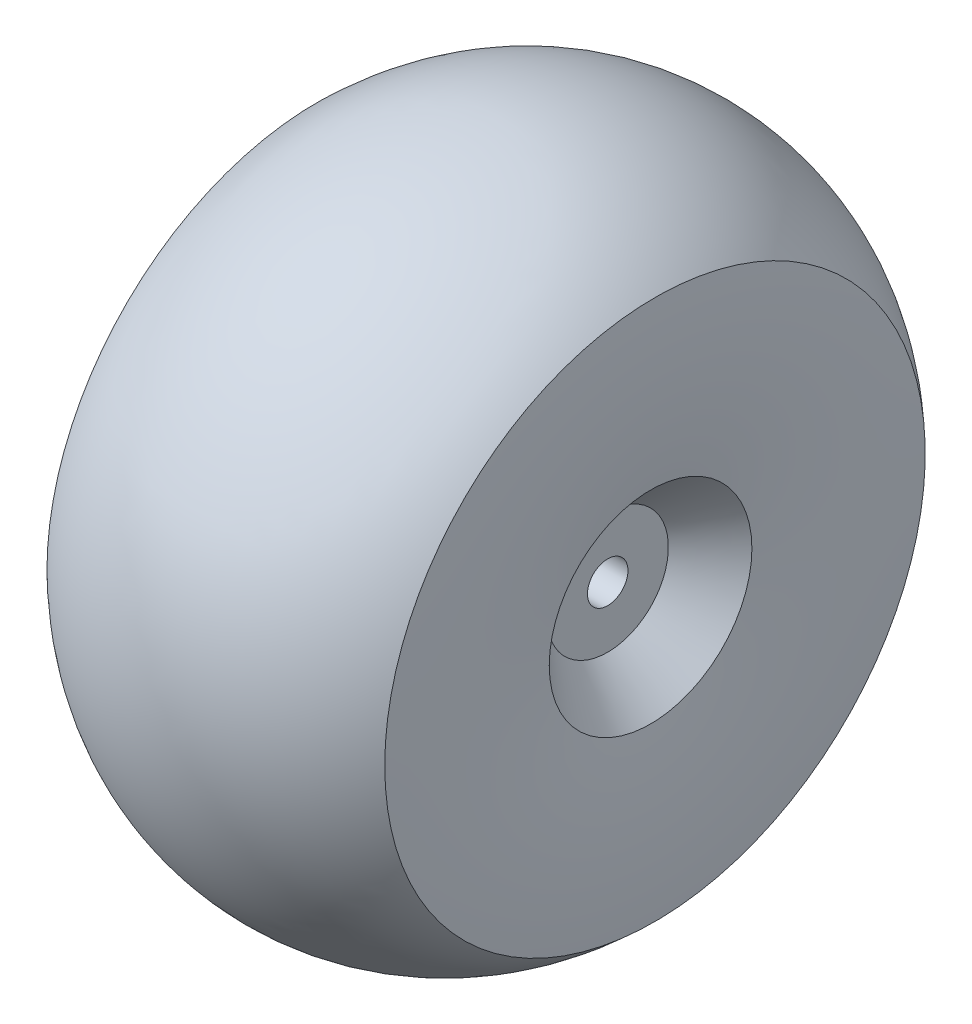
ISO-10303-21;
HEADER;
FILE_DESCRIPTION(('STEP AP214'),'2;1');
FILE_NAME('part.step','',(''),(''),'','','');
FILE_SCHEMA(('AUTOMOTIVE_DESIGN { 1 0 10303 214 1 1 1 1 }'));
ENDSEC;
DATA;
#1=APPLICATION_CONTEXT('core data for automotive mechanical design processes');
#2=APPLICATION_PROTOCOL_DEFINITION('international standard','automotive_design',2000,#1);
#3=PRODUCT_CONTEXT('',#1,'mechanical');
#4=PRODUCT('Part','Part','',(#3));
#5=PRODUCT_RELATED_PRODUCT_CATEGORY('part','',(#4));
#6=PRODUCT_DEFINITION_FORMATION('','',#4);
#7=PRODUCT_DEFINITION_CONTEXT('part definition',#1,'design');
#8=PRODUCT_DEFINITION('design','',#6,#7);
#9=PRODUCT_DEFINITION_SHAPE('','',#8);
#10=(LENGTH_UNIT() NAMED_UNIT(*) SI_UNIT(.MILLI.,.METRE.));
#11=(NAMED_UNIT(*) PLANE_ANGLE_UNIT() SI_UNIT($,.RADIAN.));
#12=(NAMED_UNIT(*) SI_UNIT($,.STERADIAN.) SOLID_ANGLE_UNIT());
#13=UNCERTAINTY_MEASURE_WITH_UNIT(LENGTH_MEASURE(1.E-05),#10,'distance_accuracy_value','');
#14=(GEOMETRIC_REPRESENTATION_CONTEXT(3) GLOBAL_UNCERTAINTY_ASSIGNED_CONTEXT((#13)) GLOBAL_UNIT_ASSIGNED_CONTEXT((#10,
#11,#12)) REPRESENTATION_CONTEXT('',''));
#15=CARTESIAN_POINT('',(0.,0.,0.));
#16=DIRECTION('',(0.,0.,1.));
#17=DIRECTION('',(1.,0.,0.));
#18=AXIS2_PLACEMENT_3D('',#15,#16,#17);
#19=CARTESIAN_POINT('',(-52.6401972971853,0.,0.));
#20=DIRECTION('',(-1.,0.,0.));
#21=DIRECTION('',(0.,0.,1.));
#22=AXIS2_PLACEMENT_3D('',#19,#20,#21);
#23=DEGENERATE_TOROIDAL_SURFACE('',#22,15.4514704568728,65.2988087557571,.T.);
#24=CARTESIAN_POINT('',(12.5,0.,0.));
#25=DIRECTION('',(-1.,0.,0.));
#26=DIRECTION('',(0.,0.,1.));
#27=AXIS2_PLACEMENT_3D('',#24,#25,#26);
#28=CIRCLE('',#27,20.);
#29=CARTESIAN_POINT('',(12.5,0.,20.));
#30=VERTEX_POINT('',#29);
#31=EDGE_CURVE('E74',#30,#30,#28,.T.);
#32=ORIENTED_EDGE('',*,*,#31,.F.);
#33=EDGE_LOOP('',(#32));
#34=FACE_BOUND('',#33,.T.);
#35=CARTESIAN_POINT('',(12.1726759803852,0.,0.));
#36=DIRECTION('',(-1.,0.,0.));
#37=DIRECTION('',(0.,0.,1.));
#38=AXIS2_PLACEMENT_3D('',#35,#36,#37);
#39=CIRCLE('',#38,7.5);
#40=CARTESIAN_POINT('',(12.1726759803852,0.,7.5));
#41=VERTEX_POINT('',#40);
#42=EDGE_CURVE('E10',#41,#41,#39,.T.);
#43=ORIENTED_EDGE('',*,*,#42,.T.);
#44=EDGE_LOOP('',(#43));
#45=FACE_BOUND('',#44,.T.);
#46=ADVANCED_FACE('F39',(#34,#45),#23,.T.);
#47=CARTESIAN_POINT('',(9.,0.,0.));
#48=DIRECTION('',(1.,0.,0.));
#49=DIRECTION('',(0.,0.,-1.));
#50=AXIS2_PLACEMENT_3D('',#47,#48,#49);
#51=CONICAL_SURFACE('',#50,4.48924291294705,0.75921822461754);
#52=ORIENTED_EDGE('',*,*,#42,.F.);
#53=EDGE_LOOP('',(#52));
#54=FACE_BOUND('',#53,.T.);
#55=CARTESIAN_POINT('',(9.,0.,0.));
#56=DIRECTION('',(-1.,0.,0.));
#57=DIRECTION('',(0.,0.,1.));
#58=AXIS2_PLACEMENT_3D('',#55,#56,#57);
#59=CIRCLE('',#58,4.48924291294705);
#60=CARTESIAN_POINT('',(9.,0.,4.48924291294705));
#61=VERTEX_POINT('',#60);
#62=EDGE_CURVE('E46',#61,#61,#59,.T.);
#63=ORIENTED_EDGE('',*,*,#62,.T.);
#64=EDGE_LOOP('',(#63));
#65=FACE_BOUND('',#64,.T.);
#66=ADVANCED_FACE('F82',(#54,#65),#51,.F.);
#67=CARTESIAN_POINT('',(9.,4.48924291294705,0.));
#68=DIRECTION('',(-1.,0.,0.));
#69=DIRECTION('',(0.,0.,1.));
#70=AXIS2_PLACEMENT_3D('',#67,#68,#69);
#71=PLANE('',#70);
#72=ORIENTED_EDGE('',*,*,#62,.F.);
#73=EDGE_LOOP('',(#72));
#74=FACE_BOUND('',#73,.T.);
#75=CARTESIAN_POINT('',(9.,0.,0.));
#76=DIRECTION('',(-1.,0.,0.));
#77=DIRECTION('',(0.,0.,1.));
#78=AXIS2_PLACEMENT_3D('',#75,#76,#77);
#79=CIRCLE('',#78,1.5);
#80=CARTESIAN_POINT('',(9.,0.,1.5));
#81=VERTEX_POINT('',#80);
#82=EDGE_CURVE('E51',#81,#81,#79,.T.);
#83=ORIENTED_EDGE('',*,*,#82,.T.);
#84=EDGE_LOOP('',(#83));
#85=FACE_BOUND('',#84,.T.);
#86=ADVANCED_FACE('F86',(#74,#85),#71,.F.);
#87=CARTESIAN_POINT('',(0.,0.,0.));
#88=DIRECTION('',(-1.,0.,0.));
#89=DIRECTION('',(0.,0.,1.));
#90=AXIS2_PLACEMENT_3D('',#87,#88,#89);
#91=CYLINDRICAL_SURFACE('',#90,1.5);
#92=ORIENTED_EDGE('',*,*,#82,.F.);
#93=EDGE_LOOP('',(#92));
#94=FACE_BOUND('',#93,.T.);
#95=CARTESIAN_POINT('',(-9.,0.,0.));
#96=DIRECTION('',(-1.,0.,0.));
#97=DIRECTION('',(0.,0.,1.));
#98=AXIS2_PLACEMENT_3D('',#95,#96,#97);
#99=CIRCLE('',#98,1.5);
#100=CARTESIAN_POINT('',(-9.,0.,1.5));
#101=VERTEX_POINT('',#100);
#102=EDGE_CURVE('E56',#101,#101,#99,.T.);
#103=ORIENTED_EDGE('',*,*,#102,.T.);
#104=EDGE_LOOP('',(#103));
#105=FACE_BOUND('',#104,.T.);
#106=ADVANCED_FACE('F91',(#94,#105),#91,.F.);
#107=CARTESIAN_POINT('',(-9.,4.48924291294705,0.));
#108=DIRECTION('',(1.,0.,0.));
#109=DIRECTION('',(0.,0.,-1.));
#110=AXIS2_PLACEMENT_3D('',#107,#108,#109);
#111=PLANE('',#110);
#112=ORIENTED_EDGE('',*,*,#102,.F.);
#113=EDGE_LOOP('',(#112));
#114=FACE_BOUND('',#113,.T.);
#115=CARTESIAN_POINT('',(-9.,0.,0.));
#116=DIRECTION('',(-1.,0.,0.));
#117=DIRECTION('',(0.,0.,1.));
#118=AXIS2_PLACEMENT_3D('',#115,#116,#117);
#119=CIRCLE('',#118,4.48924291294705);
#120=CARTESIAN_POINT('',(-9.,0.,4.48924291294705));
#121=VERTEX_POINT('',#120);
#122=EDGE_CURVE('E62',#121,#121,#119,.T.);
#123=ORIENTED_EDGE('',*,*,#122,.T.);
#124=EDGE_LOOP('',(#123));
#125=FACE_BOUND('',#124,.T.);
#126=ADVANCED_FACE('F97',(#114,#125),#111,.F.);
#127=CARTESIAN_POINT('',(-12.1726759803852,0.,0.));
#128=DIRECTION('',(-1.,0.,0.));
#129=DIRECTION('',(0.,0.,1.));
#130=AXIS2_PLACEMENT_3D('',#127,#128,#129);
#131=CONICAL_SURFACE('',#130,7.50000000000001,0.75921822461754);
#132=ORIENTED_EDGE('',*,*,#122,.F.);
#133=EDGE_LOOP('',(#132));
#134=FACE_BOUND('',#133,.T.);
#135=CARTESIAN_POINT('',(-12.1726759803852,0.,0.));
#136=DIRECTION('',(-1.,0.,0.));
#137=DIRECTION('',(0.,0.,1.));
#138=AXIS2_PLACEMENT_3D('',#135,#136,#137);
#139=CIRCLE('',#138,7.50000000000001);
#140=CARTESIAN_POINT('',(-12.1726759803852,0.,7.50000000000001));
#141=VERTEX_POINT('',#140);
#142=EDGE_CURVE('E66',#141,#141,#139,.T.);
#143=ORIENTED_EDGE('',*,*,#142,.T.);
#144=EDGE_LOOP('',(#143));
#145=FACE_BOUND('',#144,.T.);
#146=ADVANCED_FACE('F101',(#134,#145),#131,.F.);
#147=CARTESIAN_POINT('',(52.6401972971853,0.,0.));
#148=DIRECTION('',(-1.,0.,0.));
#149=DIRECTION('',(0.,0.,1.));
#150=AXIS2_PLACEMENT_3D('',#147,#148,#149);
#151=DEGENERATE_TOROIDAL_SURFACE('',#150,15.4514704568728,65.2988087557571,.T.);
#152=ORIENTED_EDGE('',*,*,#142,.F.);
#153=EDGE_LOOP('',(#152));
#154=FACE_BOUND('',#153,.T.);
#155=CARTESIAN_POINT('',(-12.5,0.,0.));
#156=DIRECTION('',(-1.,0.,0.));
#157=DIRECTION('',(0.,0.,1.));
#158=AXIS2_PLACEMENT_3D('',#155,#156,#157);
#159=CIRCLE('',#158,20.);
#160=CARTESIAN_POINT('',(-12.5,0.,20.));
#161=VERTEX_POINT('',#160);
#162=EDGE_CURVE('E70',#161,#161,#159,.T.);
#163=ORIENTED_EDGE('',*,*,#162,.T.);
#164=EDGE_LOOP('',(#163));
#165=FACE_BOUND('',#164,.T.);
#166=ADVANCED_FACE('F105',(#154,#165),#151,.T.);
#167=CARTESIAN_POINT('',(0.,0.,0.));
#168=DIRECTION('',(-1.,0.,0.));
#169=DIRECTION('',(0.,0.,1.));
#170=AXIS2_PLACEMENT_3D('',#167,#168,#169);
#171=DEGENERATE_TOROIDAL_SURFACE('',#170,6.875,18.125,.T.);
#172=ORIENTED_EDGE('',*,*,#162,.F.);
#173=EDGE_LOOP('',(#172));
#174=FACE_BOUND('',#173,.T.);
#175=ORIENTED_EDGE('',*,*,#31,.T.);
#176=EDGE_LOOP('',(#175));
#177=FACE_BOUND('',#176,.T.);
#178=ADVANCED_FACE('F79',(#174,#177),#171,.T.);
#179=CLOSED_SHELL('',(#46,#66,#86,#106,#126,#146,#166,#178));
#180=MANIFOLD_SOLID_BREP('B2',#179);
#181=ADVANCED_BREP_SHAPE_REPRESENTATION('',(#18,#180),#14);
#182=SHAPE_DEFINITION_REPRESENTATION(#9,#181);
ENDSEC;
END-ISO-10303-21;
